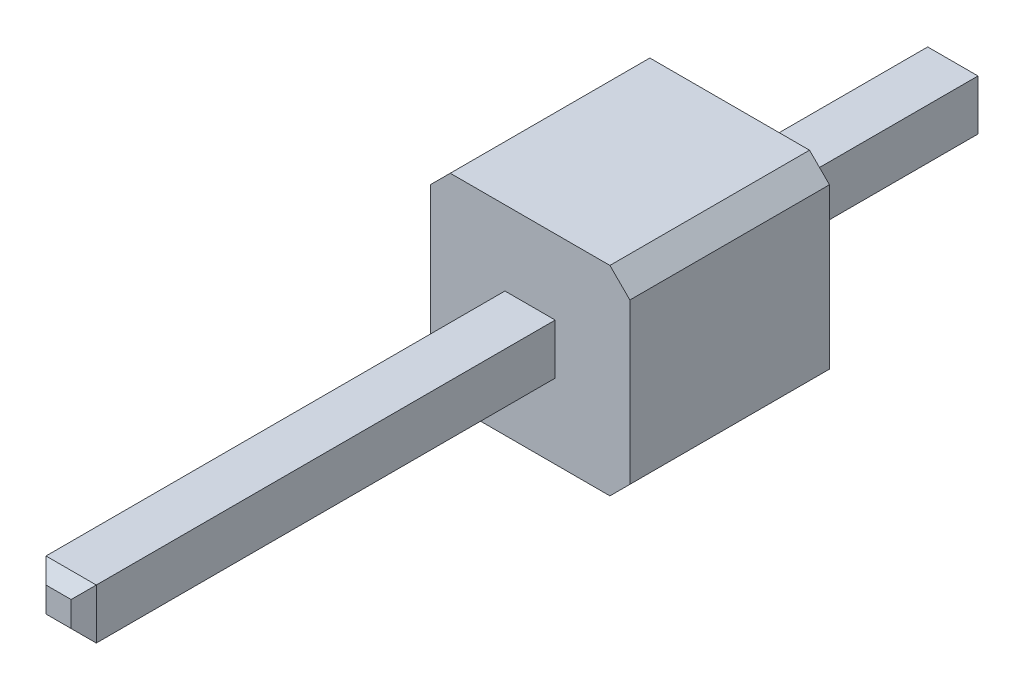
ISO-10303-21;
HEADER;
FILE_DESCRIPTION(('STEP AP214'),'2;1');
FILE_NAME('part.step','',(''),(''),'','','');
FILE_SCHEMA(('AUTOMOTIVE_DESIGN { 1 0 10303 214 1 1 1 1 }'));
ENDSEC;
DATA;
#1=APPLICATION_CONTEXT('core data for automotive mechanical design processes');
#2=APPLICATION_PROTOCOL_DEFINITION('international standard','automotive_design',2000,#1);
#3=PRODUCT_CONTEXT('',#1,'mechanical');
#4=PRODUCT('Part','Part','',(#3));
#5=PRODUCT_RELATED_PRODUCT_CATEGORY('part','',(#4));
#6=PRODUCT_DEFINITION_FORMATION('','',#4);
#7=PRODUCT_DEFINITION_CONTEXT('part definition',#1,'design');
#8=PRODUCT_DEFINITION('design','',#6,#7);
#9=PRODUCT_DEFINITION_SHAPE('','',#8);
#10=(LENGTH_UNIT() NAMED_UNIT(*) SI_UNIT(.MILLI.,.METRE.));
#11=(NAMED_UNIT(*) PLANE_ANGLE_UNIT() SI_UNIT($,.RADIAN.));
#12=(NAMED_UNIT(*) SI_UNIT($,.STERADIAN.) SOLID_ANGLE_UNIT());
#13=UNCERTAINTY_MEASURE_WITH_UNIT(LENGTH_MEASURE(1.E-05),#10,'distance_accuracy_value','');
#14=(GEOMETRIC_REPRESENTATION_CONTEXT(3) GLOBAL_UNCERTAINTY_ASSIGNED_CONTEXT((#13)) GLOBAL_UNIT_ASSIGNED_CONTEXT((#10,
#11,#12)) REPRESENTATION_CONTEXT('',''));
#15=CARTESIAN_POINT('',(0.,0.,0.));
#16=DIRECTION('',(0.,0.,1.));
#17=DIRECTION('',(1.,0.,0.));
#18=AXIS2_PLACEMENT_3D('',#15,#16,#17);
#19=CARTESIAN_POINT('',(-0.32,-0.32,8.54));
#20=DIRECTION('',(0.,0.,1.));
#21=DIRECTION('',(1.,0.,0.));
#22=AXIS2_PLACEMENT_3D('',#19,#20,#21);
#23=PLANE('',#22);
#24=DIRECTION('',(0.,1.,0.));
#25=VECTOR('',#24,1.);
#26=CARTESIAN_POINT('',(0.16,-0.32,8.54));
#27=LINE('',#26,#25);
#28=CARTESIAN_POINT('',(0.16,-0.16,8.54));
#29=VERTEX_POINT('',#28);
#30=CARTESIAN_POINT('',(0.16,0.16,8.54));
#31=VERTEX_POINT('',#30);
#32=EDGE_CURVE('E277',#29,#31,#27,.T.);
#33=ORIENTED_EDGE('',*,*,#32,.T.);
#34=DIRECTION('',(1.,0.,0.));
#35=VECTOR('',#34,1.);
#36=CARTESIAN_POINT('',(-0.32,0.16,8.54));
#37=LINE('',#36,#35);
#38=CARTESIAN_POINT('',(-0.16,0.16,8.54));
#39=VERTEX_POINT('',#38);
#40=EDGE_CURVE('E274',#39,#31,#37,.T.);
#41=ORIENTED_EDGE('',*,*,#40,.F.);
#42=DIRECTION('',(0.,1.,0.));
#43=VECTOR('',#42,1.);
#44=CARTESIAN_POINT('',(-0.16,-0.32,8.54));
#45=LINE('',#44,#43);
#46=CARTESIAN_POINT('',(-0.16,-0.16,8.54));
#47=VERTEX_POINT('',#46);
#48=EDGE_CURVE('E11',#47,#39,#45,.T.);
#49=ORIENTED_EDGE('',*,*,#48,.F.);
#50=DIRECTION('',(1.,0.,0.));
#51=VECTOR('',#50,1.);
#52=CARTESIAN_POINT('',(-0.32,-0.16,8.54));
#53=LINE('',#52,#51);
#54=EDGE_CURVE('E315',#47,#29,#53,.T.);
#55=ORIENTED_EDGE('',*,*,#54,.T.);
#56=EDGE_LOOP('',(#33,#41,#49,#55));
#57=FACE_BOUND('',#56,.T.);
#58=ADVANCED_FACE('F16',(#57),#23,.T.);
#59=CARTESIAN_POINT('',(-0.32,-0.32,-3.));
#60=DIRECTION('',(0.,0.,1.));
#61=DIRECTION('',(1.,0.,0.));
#62=AXIS2_PLACEMENT_3D('',#59,#60,#61);
#63=PLANE('',#62);
#64=DIRECTION('',(0.,1.,0.));
#65=VECTOR('',#64,1.);
#66=CARTESIAN_POINT('',(0.16,-0.32,-3.));
#67=LINE('',#66,#65);
#68=CARTESIAN_POINT('',(0.16,-0.16,-3.));
#69=VERTEX_POINT('',#68);
#70=CARTESIAN_POINT('',(0.16,0.16,-3.));
#71=VERTEX_POINT('',#70);
#72=EDGE_CURVE('E367',#69,#71,#67,.T.);
#73=ORIENTED_EDGE('',*,*,#72,.F.);
#74=DIRECTION('',(1.,0.,0.));
#75=VECTOR('',#74,1.);
#76=CARTESIAN_POINT('',(-0.32,-0.16,-3.));
#77=LINE('',#76,#75);
#78=CARTESIAN_POINT('',(-0.16,-0.16,-3.));
#79=VERTEX_POINT('',#78);
#80=EDGE_CURVE('E288',#79,#69,#77,.T.);
#81=ORIENTED_EDGE('',*,*,#80,.F.);
#82=DIRECTION('',(0.,1.,0.));
#83=VECTOR('',#82,1.);
#84=CARTESIAN_POINT('',(-0.16,-0.32,-3.));
#85=LINE('',#84,#83);
#86=CARTESIAN_POINT('',(-0.16,0.16,-3.));
#87=VERTEX_POINT('',#86);
#88=EDGE_CURVE('E250',#79,#87,#85,.T.);
#89=ORIENTED_EDGE('',*,*,#88,.T.);
#90=DIRECTION('',(1.,0.,0.));
#91=VECTOR('',#90,1.);
#92=CARTESIAN_POINT('',(-0.32,0.16,-3.));
#93=LINE('',#92,#91);
#94=EDGE_CURVE('E254',#87,#71,#93,.T.);
#95=ORIENTED_EDGE('',*,*,#94,.T.);
#96=EDGE_LOOP('',(#73,#81,#89,#95));
#97=FACE_BOUND('',#96,.T.);
#98=ADVANCED_FACE('F427',(#97),#63,.F.);
#99=CARTESIAN_POINT('',(-0.24,-0.32,8.46));
#100=DIRECTION('',(0.707106781186548,0.,-0.707106781186548));
#101=DIRECTION('',(0.,-1.,0.));
#102=AXIS2_PLACEMENT_3D('',#99,#100,#101);
#103=PLANE('',#102);
#104=ORIENTED_EDGE('',*,*,#48,.T.);
#105=DIRECTION('',(0.577350269189626,-0.577350269189626,0.577350269189626));
#106=VECTOR('',#105,1.);
#107=CARTESIAN_POINT('',(-0.16,0.16,8.54));
#108=LINE('',#107,#106);
#109=CARTESIAN_POINT('',(-0.32,0.32,8.38));
#110=VERTEX_POINT('',#109);
#111=EDGE_CURVE('E27',#110,#39,#108,.T.);
#112=ORIENTED_EDGE('',*,*,#111,.F.);
#113=DIRECTION('',(0.,1.,0.));
#114=VECTOR('',#113,1.);
#115=CARTESIAN_POINT('',(-0.32,-0.32,8.38));
#116=LINE('',#115,#114);
#117=CARTESIAN_POINT('',(-0.32,-0.32,8.38));
#118=VERTEX_POINT('',#117);
#119=EDGE_CURVE('E285',#118,#110,#116,.T.);
#120=ORIENTED_EDGE('',*,*,#119,.F.);
#121=DIRECTION('',(0.577350269189626,0.577350269189626,0.577350269189626));
#122=VECTOR('',#121,1.);
#123=CARTESIAN_POINT('',(-0.266666666667,-0.266666666667,8.433333333333));
#124=LINE('',#123,#122);
#125=EDGE_CURVE('E253',#118,#47,#124,.T.);
#126=ORIENTED_EDGE('',*,*,#125,.T.);
#127=EDGE_LOOP('',(#104,#112,#120,#126));
#128=FACE_BOUND('',#127,.T.);
#129=ADVANCED_FACE('F474',(#128),#103,.F.);
#130=CARTESIAN_POINT('',(-0.32,0.24,8.46));
#131=DIRECTION('',(0.,0.707106781186548,0.707106781186548));
#132=DIRECTION('',(1.,0.,0.));
#133=AXIS2_PLACEMENT_3D('',#130,#131,#132);
#134=PLANE('',#133);
#135=ORIENTED_EDGE('',*,*,#40,.T.);
#136=DIRECTION('',(-0.577350269189626,-0.577350269189626,0.577350269189626));
#137=VECTOR('',#136,1.);
#138=CARTESIAN_POINT('',(0.05333333333333,0.05333333333333,8.646666666667));
#139=LINE('',#138,#137);
#140=CARTESIAN_POINT('',(0.32,0.32,8.38));
#141=VERTEX_POINT('',#140);
#142=EDGE_CURVE('E313',#141,#31,#139,.T.);
#143=ORIENTED_EDGE('',*,*,#142,.F.);
#144=DIRECTION('',(1.,0.,0.));
#145=VECTOR('',#144,1.);
#146=CARTESIAN_POINT('',(-0.32,0.32,8.38));
#147=LINE('',#146,#145);
#148=EDGE_CURVE('E289',#110,#141,#147,.T.);
#149=ORIENTED_EDGE('',*,*,#148,.F.);
#150=ORIENTED_EDGE('',*,*,#111,.T.);
#151=EDGE_LOOP('',(#135,#143,#149,#150));
#152=FACE_BOUND('',#151,.T.);
#153=ADVANCED_FACE('F477',(#152),#134,.T.);
#154=CARTESIAN_POINT('',(0.24,-0.32,8.46));
#155=DIRECTION('',(0.707106781186548,0.,0.707106781186548));
#156=DIRECTION('',(0.,-1.,0.));
#157=AXIS2_PLACEMENT_3D('',#154,#155,#156);
#158=PLANE('',#157);
#159=DIRECTION('',(-0.577350269189626,0.577350269189626,0.577350269189626));
#160=VECTOR('',#159,1.);
#161=CARTESIAN_POINT('',(0.16,-0.16,8.54));
#162=LINE('',#161,#160);
#163=CARTESIAN_POINT('',(0.32,-0.32,8.38));
#164=VERTEX_POINT('',#163);
#165=EDGE_CURVE('E323',#164,#29,#162,.T.);
#166=ORIENTED_EDGE('',*,*,#165,.F.);
#167=DIRECTION('',(0.,1.,0.));
#168=VECTOR('',#167,1.);
#169=CARTESIAN_POINT('',(0.32,-0.32,8.38));
#170=LINE('',#169,#168);
#171=EDGE_CURVE('E310',#164,#141,#170,.T.);
#172=ORIENTED_EDGE('',*,*,#171,.T.);
#173=ORIENTED_EDGE('',*,*,#142,.T.);
#174=ORIENTED_EDGE('',*,*,#32,.F.);
#175=EDGE_LOOP('',(#166,#172,#173,#174));
#176=FACE_BOUND('',#175,.T.);
#177=ADVANCED_FACE('F478',(#176),#158,.T.);
#178=CARTESIAN_POINT('',(-0.32,-0.24,8.46));
#179=DIRECTION('',(0.,0.707106781186548,-0.707106781186548));
#180=DIRECTION('',(-1.,0.,0.));
#181=AXIS2_PLACEMENT_3D('',#178,#179,#180);
#182=PLANE('',#181);
#183=ORIENTED_EDGE('',*,*,#125,.F.);
#184=DIRECTION('',(1.,0.,0.));
#185=VECTOR('',#184,1.);
#186=CARTESIAN_POINT('',(-0.32,-0.32,8.38));
#187=LINE('',#186,#185);
#188=EDGE_CURVE('E362',#118,#164,#187,.T.);
#189=ORIENTED_EDGE('',*,*,#188,.T.);
#190=ORIENTED_EDGE('',*,*,#165,.T.);
#191=ORIENTED_EDGE('',*,*,#54,.F.);
#192=EDGE_LOOP('',(#183,#189,#190,#191));
#193=FACE_BOUND('',#192,.T.);
#194=ADVANCED_FACE('F473',(#193),#182,.F.);
#195=CARTESIAN_POINT('',(-0.24,-0.32,-2.92));
#196=DIRECTION('',(-0.707106781186548,0.,-0.707106781186548));
#197=DIRECTION('',(-0.707106781186548,0.,0.707106781186548));
#198=AXIS2_PLACEMENT_3D('',#195,#196,#197);
#199=PLANE('',#198);
#200=DIRECTION('',(0.577350269189626,0.577350269189626,-0.577350269189626));
#201=VECTOR('',#200,1.);
#202=CARTESIAN_POINT('',(-0.266666666667,-0.266666666667,-2.893333333333));
#203=LINE('',#202,#201);
#204=CARTESIAN_POINT('',(-0.32,-0.32,-2.84));
#205=VERTEX_POINT('',#204);
#206=EDGE_CURVE('E363',#205,#79,#203,.T.);
#207=ORIENTED_EDGE('',*,*,#206,.F.);
#208=DIRECTION('',(0.,1.,0.));
#209=VECTOR('',#208,1.);
#210=CARTESIAN_POINT('',(-0.32,-0.32,-2.84));
#211=LINE('',#210,#209);
#212=CARTESIAN_POINT('',(-0.32,0.32,-2.84));
#213=VERTEX_POINT('',#212);
#214=EDGE_CURVE('E385',#205,#213,#211,.T.);
#215=ORIENTED_EDGE('',*,*,#214,.T.);
#216=DIRECTION('',(0.577350269189626,-0.577350269189626,-0.577350269189626));
#217=VECTOR('',#216,1.);
#218=CARTESIAN_POINT('',(-0.16,0.16,-3.));
#219=LINE('',#218,#217);
#220=EDGE_CURVE('E376',#213,#87,#219,.T.);
#221=ORIENTED_EDGE('',*,*,#220,.T.);
#222=ORIENTED_EDGE('',*,*,#88,.F.);
#223=EDGE_LOOP('',(#207,#215,#221,#222));
#224=FACE_BOUND('',#223,.T.);
#225=ADVANCED_FACE('F486',(#224),#199,.T.);
#226=CARTESIAN_POINT('',(-0.32,0.24,-2.92));
#227=DIRECTION('',(0.,-0.707106781186548,0.707106781186548));
#228=DIRECTION('',(-1.,0.,0.));
#229=AXIS2_PLACEMENT_3D('',#226,#227,#228);
#230=PLANE('',#229);
#231=ORIENTED_EDGE('',*,*,#220,.F.);
#232=DIRECTION('',(1.,0.,0.));
#233=VECTOR('',#232,1.);
#234=CARTESIAN_POINT('',(-0.32,0.32,-2.84));
#235=LINE('',#234,#233);
#236=CARTESIAN_POINT('',(0.32,0.32,-2.84));
#237=VERTEX_POINT('',#236);
#238=EDGE_CURVE('E343',#213,#237,#235,.T.);
#239=ORIENTED_EDGE('',*,*,#238,.T.);
#240=DIRECTION('',(-0.577350269189626,-0.577350269189626,-0.577350269189626));
#241=VECTOR('',#240,1.);
#242=CARTESIAN_POINT('',(0.05333333333333,0.05333333333333,-3.106666666667));
#243=LINE('',#242,#241);
#244=EDGE_CURVE('E380',#237,#71,#243,.T.);
#245=ORIENTED_EDGE('',*,*,#244,.T.);
#246=ORIENTED_EDGE('',*,*,#94,.F.);
#247=EDGE_LOOP('',(#231,#239,#245,#246));
#248=FACE_BOUND('',#247,.T.);
#249=ADVANCED_FACE('F419',(#248),#230,.F.);
#250=CARTESIAN_POINT('',(0.24,-0.32,-2.92));
#251=DIRECTION('',(-0.707106781186548,0.,0.707106781186548));
#252=DIRECTION('',(0.,1.,0.));
#253=AXIS2_PLACEMENT_3D('',#250,#251,#252);
#254=PLANE('',#253);
#255=ORIENTED_EDGE('',*,*,#72,.T.);
#256=ORIENTED_EDGE('',*,*,#244,.F.);
#257=DIRECTION('',(0.,1.,0.));
#258=VECTOR('',#257,1.);
#259=CARTESIAN_POINT('',(0.32,-0.32,-2.84));
#260=LINE('',#259,#258);
#261=CARTESIAN_POINT('',(0.32,-0.32,-2.84));
#262=VERTEX_POINT('',#261);
#263=EDGE_CURVE('E344',#262,#237,#260,.T.);
#264=ORIENTED_EDGE('',*,*,#263,.F.);
#265=DIRECTION('',(-0.577350269189626,0.577350269189626,-0.577350269189626));
#266=VECTOR('',#265,1.);
#267=CARTESIAN_POINT('',(0.16,-0.16,-3.));
#268=LINE('',#267,#266);
#269=EDGE_CURVE('E298',#262,#69,#268,.T.);
#270=ORIENTED_EDGE('',*,*,#269,.T.);
#271=EDGE_LOOP('',(#255,#256,#264,#270));
#272=FACE_BOUND('',#271,.T.);
#273=ADVANCED_FACE('F424',(#272),#254,.F.);
#274=CARTESIAN_POINT('',(-0.32,-0.24,-2.92));
#275=DIRECTION('',(0.,-0.707106781186548,-0.707106781186548));
#276=DIRECTION('',(0.,-0.707106781186548,0.707106781186548));
#277=AXIS2_PLACEMENT_3D('',#274,#275,#276);
#278=PLANE('',#277);
#279=ORIENTED_EDGE('',*,*,#80,.T.);
#280=ORIENTED_EDGE('',*,*,#269,.F.);
#281=DIRECTION('',(1.,0.,0.));
#282=VECTOR('',#281,1.);
#283=CARTESIAN_POINT('',(-0.32,-0.32,-2.84));
#284=LINE('',#283,#282);
#285=EDGE_CURVE('E284',#205,#262,#284,.T.);
#286=ORIENTED_EDGE('',*,*,#285,.F.);
#287=ORIENTED_EDGE('',*,*,#206,.T.);
#288=EDGE_LOOP('',(#279,#280,#286,#287));
#289=FACE_BOUND('',#288,.T.);
#290=ADVANCED_FACE('F516',(#289),#278,.T.);
#291=CARTESIAN_POINT('',(-0.32,-0.32,-3.));
#292=DIRECTION('',(1.,0.,0.));
#293=DIRECTION('',(0.,1.,0.));
#294=AXIS2_PLACEMENT_3D('',#291,#292,#293);
#295=PLANE('',#294);
#296=ORIENTED_EDGE('',*,*,#119,.T.);
#297=DIRECTION('',(0.,0.,1.));
#298=VECTOR('',#297,1.);
#299=CARTESIAN_POINT('',(-0.32,0.32,-3.));
#300=LINE('',#299,#298);
#301=CARTESIAN_POINT('',(-0.32,0.32,2.54));
#302=VERTEX_POINT('',#301);
#303=EDGE_CURVE('E302',#302,#110,#300,.T.);
#304=ORIENTED_EDGE('',*,*,#303,.F.);
#305=DIRECTION('',(0.,1.,0.));
#306=VECTOR('',#305,1.);
#307=CARTESIAN_POINT('',(-0.32,-0.16,2.54));
#308=LINE('',#307,#306);
#309=CARTESIAN_POINT('',(-0.32,-0.32,2.54));
#310=VERTEX_POINT('',#309);
#311=EDGE_CURVE('E244',#310,#302,#308,.T.);
#312=ORIENTED_EDGE('',*,*,#311,.F.);
#313=DIRECTION('',(0.,0.,1.));
#314=VECTOR('',#313,1.);
#315=CARTESIAN_POINT('',(-0.32,-0.32,-3.));
#316=LINE('',#315,#314);
#317=EDGE_CURVE('E358',#310,#118,#316,.T.);
#318=ORIENTED_EDGE('',*,*,#317,.T.);
#319=EDGE_LOOP('',(#296,#304,#312,#318));
#320=FACE_BOUND('',#319,.T.);
#321=ADVANCED_FACE('F469',(#320),#295,.F.);
#322=CARTESIAN_POINT('',(-0.32,0.32,-3.));
#323=DIRECTION('',(0.,1.,0.));
#324=DIRECTION('',(1.,0.,0.));
#325=AXIS2_PLACEMENT_3D('',#322,#323,#324);
#326=PLANE('',#325);
#327=DIRECTION('',(0.,0.,1.));
#328=VECTOR('',#327,1.);
#329=CARTESIAN_POINT('',(0.32,0.32,-3.));
#330=LINE('',#329,#328);
#331=CARTESIAN_POINT('',(0.32,0.32,2.54));
#332=VERTEX_POINT('',#331);
#333=EDGE_CURVE('E413',#332,#141,#330,.T.);
#334=ORIENTED_EDGE('',*,*,#333,.F.);
#335=DIRECTION('',(-1.,0.,0.));
#336=VECTOR('',#335,1.);
#337=CARTESIAN_POINT('',(-0.16,0.32,2.54));
#338=LINE('',#337,#336);
#339=EDGE_CURVE('E248',#332,#302,#338,.T.);
#340=ORIENTED_EDGE('',*,*,#339,.T.);
#341=ORIENTED_EDGE('',*,*,#303,.T.);
#342=ORIENTED_EDGE('',*,*,#148,.T.);
#343=EDGE_LOOP('',(#334,#340,#341,#342));
#344=FACE_BOUND('',#343,.T.);
#345=ADVANCED_FACE('F465',(#344),#326,.T.);
#346=CARTESIAN_POINT('',(0.32,-0.32,-3.));
#347=DIRECTION('',(1.,0.,0.));
#348=DIRECTION('',(0.,1.,0.));
#349=AXIS2_PLACEMENT_3D('',#346,#347,#348);
#350=PLANE('',#349);
#351=DIRECTION('',(0.,0.,1.));
#352=VECTOR('',#351,1.);
#353=CARTESIAN_POINT('',(0.32,-0.32,-3.));
#354=LINE('',#353,#352);
#355=CARTESIAN_POINT('',(0.32,-0.32,2.54));
#356=VERTEX_POINT('',#355);
#357=EDGE_CURVE('E361',#356,#164,#354,.T.);
#358=ORIENTED_EDGE('',*,*,#357,.F.);
#359=DIRECTION('',(0.,1.,0.));
#360=VECTOR('',#359,1.);
#361=CARTESIAN_POINT('',(0.32,-0.16,2.54));
#362=LINE('',#361,#360);
#363=EDGE_CURVE('E273',#356,#332,#362,.T.);
#364=ORIENTED_EDGE('',*,*,#363,.T.);
#365=ORIENTED_EDGE('',*,*,#333,.T.);
#366=ORIENTED_EDGE('',*,*,#171,.F.);
#367=EDGE_LOOP('',(#358,#364,#365,#366));
#368=FACE_BOUND('',#367,.T.);
#369=ADVANCED_FACE('F462',(#368),#350,.T.);
#370=CARTESIAN_POINT('',(-0.32,-0.32,-3.));
#371=DIRECTION('',(0.,1.,0.));
#372=DIRECTION('',(1.,0.,0.));
#373=AXIS2_PLACEMENT_3D('',#370,#371,#372);
#374=PLANE('',#373);
#375=ORIENTED_EDGE('',*,*,#188,.F.);
#376=ORIENTED_EDGE('',*,*,#317,.F.);
#377=DIRECTION('',(-1.,0.,0.));
#378=VECTOR('',#377,1.);
#379=CARTESIAN_POINT('',(-0.16,-0.32,2.54));
#380=LINE('',#379,#378);
#381=EDGE_CURVE('E249',#356,#310,#380,.T.);
#382=ORIENTED_EDGE('',*,*,#381,.F.);
#383=ORIENTED_EDGE('',*,*,#357,.T.);
#384=EDGE_LOOP('',(#375,#376,#382,#383));
#385=FACE_BOUND('',#384,.T.);
#386=ADVANCED_FACE('F18',(#385),#374,.F.);
#387=CARTESIAN_POINT('',(-0.32,-0.32,-3.));
#388=DIRECTION('',(1.,0.,0.));
#389=DIRECTION('',(0.,1.,0.));
#390=AXIS2_PLACEMENT_3D('',#387,#388,#389);
#391=PLANE('',#390);
#392=DIRECTION('',(0.,1.,0.));
#393=VECTOR('',#392,1.);
#394=CARTESIAN_POINT('',(-0.32,-0.16,0.));
#395=LINE('',#394,#393);
#396=CARTESIAN_POINT('',(-0.32,-0.32,0.));
#397=VERTEX_POINT('',#396);
#398=CARTESIAN_POINT('',(-0.32,0.32,0.));
#399=VERTEX_POINT('',#398);
#400=EDGE_CURVE('E243',#397,#399,#395,.T.);
#401=ORIENTED_EDGE('',*,*,#400,.T.);
#402=DIRECTION('',(0.,0.,1.));
#403=VECTOR('',#402,1.);
#404=CARTESIAN_POINT('',(-0.32,0.32,-3.));
#405=LINE('',#404,#403);
#406=EDGE_CURVE('E388',#213,#399,#405,.T.);
#407=ORIENTED_EDGE('',*,*,#406,.F.);
#408=ORIENTED_EDGE('',*,*,#214,.F.);
#409=DIRECTION('',(0.,0.,1.));
#410=VECTOR('',#409,1.);
#411=CARTESIAN_POINT('',(-0.32,-0.32,-3.));
#412=LINE('',#411,#410);
#413=EDGE_CURVE('E267',#205,#397,#412,.T.);
#414=ORIENTED_EDGE('',*,*,#413,.T.);
#415=EDGE_LOOP('',(#401,#407,#408,#414));
#416=FACE_BOUND('',#415,.T.);
#417=ADVANCED_FACE('F501',(#416),#391,.F.);
#418=CARTESIAN_POINT('',(-0.32,0.32,-3.));
#419=DIRECTION('',(0.,1.,0.));
#420=DIRECTION('',(1.,0.,0.));
#421=AXIS2_PLACEMENT_3D('',#418,#419,#420);
#422=PLANE('',#421);
#423=DIRECTION('',(0.,0.,1.));
#424=VECTOR('',#423,1.);
#425=CARTESIAN_POINT('',(0.32,0.32,-3.));
#426=LINE('',#425,#424);
#427=CARTESIAN_POINT('',(0.32,0.32,0.));
#428=VERTEX_POINT('',#427);
#429=EDGE_CURVE('E340',#237,#428,#426,.T.);
#430=ORIENTED_EDGE('',*,*,#429,.F.);
#431=ORIENTED_EDGE('',*,*,#238,.F.);
#432=ORIENTED_EDGE('',*,*,#406,.T.);
#433=DIRECTION('',(-1.,0.,0.));
#434=VECTOR('',#433,1.);
#435=CARTESIAN_POINT('',(-0.16,0.32,0.));
#436=LINE('',#435,#434);
#437=EDGE_CURVE('E232',#428,#399,#436,.T.);
#438=ORIENTED_EDGE('',*,*,#437,.F.);
#439=EDGE_LOOP('',(#430,#431,#432,#438));
#440=FACE_BOUND('',#439,.T.);
#441=ADVANCED_FACE('F499',(#440),#422,.T.);
#442=CARTESIAN_POINT('',(0.32,-0.32,-3.));
#443=DIRECTION('',(1.,0.,0.));
#444=DIRECTION('',(0.,1.,0.));
#445=AXIS2_PLACEMENT_3D('',#442,#443,#444);
#446=PLANE('',#445);
#447=DIRECTION('',(0.,0.,1.));
#448=VECTOR('',#447,1.);
#449=CARTESIAN_POINT('',(0.32,-0.32,-3.));
#450=LINE('',#449,#448);
#451=CARTESIAN_POINT('',(0.32,-0.32,0.));
#452=VERTEX_POINT('',#451);
#453=EDGE_CURVE('E357',#262,#452,#450,.T.);
#454=ORIENTED_EDGE('',*,*,#453,.F.);
#455=ORIENTED_EDGE('',*,*,#263,.T.);
#456=ORIENTED_EDGE('',*,*,#429,.T.);
#457=DIRECTION('',(0.,1.,0.));
#458=VECTOR('',#457,1.);
#459=CARTESIAN_POINT('',(0.32,-0.16,0.));
#460=LINE('',#459,#458);
#461=EDGE_CURVE('E349',#452,#428,#460,.T.);
#462=ORIENTED_EDGE('',*,*,#461,.F.);
#463=EDGE_LOOP('',(#454,#455,#456,#462));
#464=FACE_BOUND('',#463,.T.);
#465=ADVANCED_FACE('F535',(#464),#446,.T.);
#466=CARTESIAN_POINT('',(-0.32,-0.32,-3.));
#467=DIRECTION('',(0.,1.,0.));
#468=DIRECTION('',(1.,0.,0.));
#469=AXIS2_PLACEMENT_3D('',#466,#467,#468);
#470=PLANE('',#469);
#471=DIRECTION('',(-1.,0.,0.));
#472=VECTOR('',#471,1.);
#473=CARTESIAN_POINT('',(-0.16,-0.32,0.));
#474=LINE('',#473,#472);
#475=EDGE_CURVE('E239',#452,#397,#474,.T.);
#476=ORIENTED_EDGE('',*,*,#475,.T.);
#477=ORIENTED_EDGE('',*,*,#413,.F.);
#478=ORIENTED_EDGE('',*,*,#285,.T.);
#479=ORIENTED_EDGE('',*,*,#453,.T.);
#480=EDGE_LOOP('',(#476,#477,#478,#479));
#481=FACE_BOUND('',#480,.T.);
#482=ADVANCED_FACE('F529',(#481),#470,.F.);
#483=CARTESIAN_POINT('',(1.016,-1.27,0.));
#484=DIRECTION('',(-0.707106781186548,0.707106781186548,0.));
#485=DIRECTION('',(0.,0.,1.));
#486=AXIS2_PLACEMENT_3D('',#483,#484,#485);
#487=PLANE('',#486);
#488=DIRECTION('',(0.707106781186548,0.707106781186548,0.));
#489=VECTOR('',#488,1.);
#490=CARTESIAN_POINT('',(1.016,-1.27,0.));
#491=LINE('',#490,#489);
#492=CARTESIAN_POINT('',(1.016,-1.27,0.));
#493=VERTEX_POINT('',#492);
#494=CARTESIAN_POINT('',(1.27,-1.016,0.));
#495=VERTEX_POINT('',#494);
#496=EDGE_CURVE('E368',#493,#495,#491,.T.);
#497=ORIENTED_EDGE('',*,*,#496,.T.);
#498=DIRECTION('',(0.,0.,1.));
#499=VECTOR('',#498,1.);
#500=CARTESIAN_POINT('',(1.27,-1.016,0.));
#501=LINE('',#500,#499);
#502=CARTESIAN_POINT('',(1.27,-1.016,2.54));
#503=VERTEX_POINT('',#502);
#504=EDGE_CURVE('E268',#495,#503,#501,.T.);
#505=ORIENTED_EDGE('',*,*,#504,.T.);
#506=DIRECTION('',(0.707106781186548,0.707106781186548,0.));
#507=VECTOR('',#506,1.);
#508=CARTESIAN_POINT('',(1.016,-1.27,2.54));
#509=LINE('',#508,#507);
#510=CARTESIAN_POINT('',(1.016,-1.27,2.54));
#511=VERTEX_POINT('',#510);
#512=EDGE_CURVE('E237',#511,#503,#509,.T.);
#513=ORIENTED_EDGE('',*,*,#512,.F.);
#514=DIRECTION('',(0.,0.,1.));
#515=VECTOR('',#514,1.);
#516=CARTESIAN_POINT('',(1.016,-1.27,0.));
#517=LINE('',#516,#515);
#518=EDGE_CURVE('E264',#493,#511,#517,.T.);
#519=ORIENTED_EDGE('',*,*,#518,.F.);
#520=EDGE_LOOP('',(#497,#505,#513,#519));
#521=FACE_BOUND('',#520,.T.);
#522=ADVANCED_FACE('F508',(#521),#487,.F.);
#523=CARTESIAN_POINT('',(-1.016,-1.27,0.));
#524=DIRECTION('',(0.,1.,0.));
#525=DIRECTION('',(1.,0.,0.));
#526=AXIS2_PLACEMENT_3D('',#523,#524,#525);
#527=PLANE('',#526);
#528=DIRECTION('',(1.,0.,0.));
#529=VECTOR('',#528,1.);
#530=CARTESIAN_POINT('',(-1.016,-1.27,0.));
#531=LINE('',#530,#529);
#532=CARTESIAN_POINT('',(-1.016,-1.27,0.));
#533=VERTEX_POINT('',#532);
#534=EDGE_CURVE('E350',#533,#493,#531,.T.);
#535=ORIENTED_EDGE('',*,*,#534,.T.);
#536=ORIENTED_EDGE('',*,*,#518,.T.);
#537=DIRECTION('',(1.,0.,0.));
#538=VECTOR('',#537,1.);
#539=CARTESIAN_POINT('',(-1.016,-1.27,2.54));
#540=LINE('',#539,#538);
#541=CARTESIAN_POINT('',(-1.016,-1.27,2.54));
#542=VERTEX_POINT('',#541);
#543=EDGE_CURVE('E234',#542,#511,#540,.T.);
#544=ORIENTED_EDGE('',*,*,#543,.F.);
#545=DIRECTION('',(0.,0.,1.));
#546=VECTOR('',#545,1.);
#547=CARTESIAN_POINT('',(-1.016,-1.27,0.));
#548=LINE('',#547,#546);
#549=EDGE_CURVE('E272',#533,#542,#548,.T.);
#550=ORIENTED_EDGE('',*,*,#549,.F.);
#551=EDGE_LOOP('',(#535,#536,#544,#550));
#552=FACE_BOUND('',#551,.T.);
#553=ADVANCED_FACE('F505',(#552),#527,.F.);
#554=CARTESIAN_POINT('',(1.27,-1.016,0.));
#555=DIRECTION('',(-1.,0.,0.));
#556=DIRECTION('',(0.,0.,1.));
#557=AXIS2_PLACEMENT_3D('',#554,#555,#556);
#558=PLANE('',#557);
#559=DIRECTION('',(0.,1.,0.));
#560=VECTOR('',#559,1.);
#561=CARTESIAN_POINT('',(1.27,-1.016,0.));
#562=LINE('',#561,#560);
#563=CARTESIAN_POINT('',(1.27,1.016,0.));
#564=VERTEX_POINT('',#563);
#565=EDGE_CURVE('E372',#495,#564,#562,.T.);
#566=ORIENTED_EDGE('',*,*,#565,.T.);
#567=DIRECTION('',(0.,0.,1.));
#568=VECTOR('',#567,1.);
#569=CARTESIAN_POINT('',(1.27,1.016,0.));
#570=LINE('',#569,#568);
#571=CARTESIAN_POINT('',(1.27,1.016,2.54));
#572=VERTEX_POINT('',#571);
#573=EDGE_CURVE('E269',#564,#572,#570,.T.);
#574=ORIENTED_EDGE('',*,*,#573,.T.);
#575=DIRECTION('',(0.,1.,0.));
#576=VECTOR('',#575,1.);
#577=CARTESIAN_POINT('',(1.27,-1.016,2.54));
#578=LINE('',#577,#576);
#579=EDGE_CURVE('E282',#503,#572,#578,.T.);
#580=ORIENTED_EDGE('',*,*,#579,.F.);
#581=ORIENTED_EDGE('',*,*,#504,.F.);
#582=EDGE_LOOP('',(#566,#574,#580,#581));
#583=FACE_BOUND('',#582,.T.);
#584=ADVANCED_FACE('F507',(#583),#558,.F.);
#585=CARTESIAN_POINT('',(-1.27,-1.016,0.));
#586=DIRECTION('',(0.707106781186548,0.707106781186548,0.));
#587=DIRECTION('',(0.,0.,-1.));
#588=AXIS2_PLACEMENT_3D('',#585,#586,#587);
#589=PLANE('',#588);
#590=DIRECTION('',(0.707106781186548,-0.707106781186548,0.));
#591=VECTOR('',#590,1.);
#592=CARTESIAN_POINT('',(-1.27,-1.016,0.));
#593=LINE('',#592,#591);
#594=CARTESIAN_POINT('',(-1.27,-1.016,0.));
#595=VERTEX_POINT('',#594);
#596=EDGE_CURVE('E345',#595,#533,#593,.T.);
#597=ORIENTED_EDGE('',*,*,#596,.T.);
#598=ORIENTED_EDGE('',*,*,#549,.T.);
#599=DIRECTION('',(0.707106781186548,-0.707106781186548,0.));
#600=VECTOR('',#599,1.);
#601=CARTESIAN_POINT('',(-1.27,-1.016,2.54));
#602=LINE('',#601,#600);
#603=CARTESIAN_POINT('',(-1.27,-1.016,2.54));
#604=VERTEX_POINT('',#603);
#605=EDGE_CURVE('E238',#604,#542,#602,.T.);
#606=ORIENTED_EDGE('',*,*,#605,.F.);
#607=DIRECTION('',(0.,0.,1.));
#608=VECTOR('',#607,1.);
#609=CARTESIAN_POINT('',(-1.27,-1.016,0.));
#610=LINE('',#609,#608);
#611=EDGE_CURVE('E258',#595,#604,#610,.T.);
#612=ORIENTED_EDGE('',*,*,#611,.F.);
#613=EDGE_LOOP('',(#597,#598,#606,#612));
#614=FACE_BOUND('',#613,.T.);
#615=ADVANCED_FACE('F540',(#614),#589,.F.);
#616=CARTESIAN_POINT('',(1.27,1.016,0.));
#617=DIRECTION('',(-0.707106781186548,-0.707106781186548,0.));
#618=DIRECTION('',(-0.707106781186548,0.707106781186548,0.));
#619=AXIS2_PLACEMENT_3D('',#616,#617,#618);
#620=PLANE('',#619);
#621=DIRECTION('',(-0.707106781186548,0.707106781186548,0.));
#622=VECTOR('',#621,1.);
#623=CARTESIAN_POINT('',(1.27,1.016,0.));
#624=LINE('',#623,#622);
#625=CARTESIAN_POINT('',(1.016,1.27,0.));
#626=VERTEX_POINT('',#625);
#627=EDGE_CURVE('E393',#564,#626,#624,.T.);
#628=ORIENTED_EDGE('',*,*,#627,.T.);
#629=DIRECTION('',(0.,0.,1.));
#630=VECTOR('',#629,1.);
#631=CARTESIAN_POINT('',(1.016,1.27,0.));
#632=LINE('',#631,#630);
#633=CARTESIAN_POINT('',(1.016,1.27,2.54));
#634=VERTEX_POINT('',#633);
#635=EDGE_CURVE('E20',#626,#634,#632,.T.);
#636=ORIENTED_EDGE('',*,*,#635,.T.);
#637=DIRECTION('',(-0.707106781186548,0.707106781186548,0.));
#638=VECTOR('',#637,1.);
#639=CARTESIAN_POINT('',(1.27,1.016,2.54));
#640=LINE('',#639,#638);
#641=EDGE_CURVE('E203',#572,#634,#640,.T.);
#642=ORIENTED_EDGE('',*,*,#641,.F.);
#643=ORIENTED_EDGE('',*,*,#573,.F.);
#644=EDGE_LOOP('',(#628,#636,#642,#643));
#645=FACE_BOUND('',#644,.T.);
#646=ADVANCED_FACE('F548',(#645),#620,.F.);
#647=CARTESIAN_POINT('',(0.,0.,2.54));
#648=DIRECTION('',(0.,0.,1.));
#649=DIRECTION('',(1.,0.,0.));
#650=AXIS2_PLACEMENT_3D('',#647,#648,#649);
#651=PLANE('',#650);
#652=ORIENTED_EDGE('',*,*,#381,.T.);
#653=ORIENTED_EDGE('',*,*,#311,.T.);
#654=ORIENTED_EDGE('',*,*,#339,.F.);
#655=ORIENTED_EDGE('',*,*,#363,.F.);
#656=EDGE_LOOP('',(#652,#653,#654,#655));
#657=FACE_BOUND('',#656,.T.);
#658=DIRECTION('',(-0.707106781186548,-0.707106781186548,0.));
#659=VECTOR('',#658,1.);
#660=CARTESIAN_POINT('',(-1.016,1.27,2.54));
#661=LINE('',#660,#659);
#662=CARTESIAN_POINT('',(-1.016,1.27,2.54));
#663=VERTEX_POINT('',#662);
#664=CARTESIAN_POINT('',(-1.27,1.016,2.54));
#665=VERTEX_POINT('',#664);
#666=EDGE_CURVE('E199',#663,#665,#661,.T.);
#667=ORIENTED_EDGE('',*,*,#666,.T.);
#668=DIRECTION('',(0.,-1.,0.));
#669=VECTOR('',#668,1.);
#670=CARTESIAN_POINT('',(-1.27,1.016,2.54));
#671=LINE('',#670,#669);
#672=EDGE_CURVE('E262',#665,#604,#671,.T.);
#673=ORIENTED_EDGE('',*,*,#672,.T.);
#674=ORIENTED_EDGE('',*,*,#605,.T.);
#675=ORIENTED_EDGE('',*,*,#543,.T.);
#676=ORIENTED_EDGE('',*,*,#512,.T.);
#677=ORIENTED_EDGE('',*,*,#579,.T.);
#678=ORIENTED_EDGE('',*,*,#641,.T.);
#679=DIRECTION('',(-1.,0.,0.));
#680=VECTOR('',#679,1.);
#681=CARTESIAN_POINT('',(1.016,1.27,2.54));
#682=LINE('',#681,#680);
#683=EDGE_CURVE('E194',#634,#663,#682,.T.);
#684=ORIENTED_EDGE('',*,*,#683,.T.);
#685=EDGE_LOOP('',(#667,#673,#674,#675,#676,#677,#678,#684));
#686=FACE_BOUND('',#685,.T.);
#687=ADVANCED_FACE('F196',(#657,#686),#651,.T.);
#688=CARTESIAN_POINT('',(0.,0.,0.));
#689=DIRECTION('',(0.,0.,1.));
#690=DIRECTION('',(1.,0.,0.));
#691=AXIS2_PLACEMENT_3D('',#688,#689,#690);
#692=PLANE('',#691);
#693=ORIENTED_EDGE('',*,*,#461,.T.);
#694=ORIENTED_EDGE('',*,*,#437,.T.);
#695=ORIENTED_EDGE('',*,*,#400,.F.);
#696=ORIENTED_EDGE('',*,*,#475,.F.);
#697=EDGE_LOOP('',(#693,#694,#695,#696));
#698=FACE_BOUND('',#697,.T.);
#699=DIRECTION('',(-1.,0.,0.));
#700=VECTOR('',#699,1.);
#701=CARTESIAN_POINT('',(1.016,1.27,0.));
#702=LINE('',#701,#700);
#703=CARTESIAN_POINT('',(-1.016,1.27,0.));
#704=VERTEX_POINT('',#703);
#705=EDGE_CURVE('E208',#626,#704,#702,.T.);
#706=ORIENTED_EDGE('',*,*,#705,.F.);
#707=ORIENTED_EDGE('',*,*,#627,.F.);
#708=ORIENTED_EDGE('',*,*,#565,.F.);
#709=ORIENTED_EDGE('',*,*,#496,.F.);
#710=ORIENTED_EDGE('',*,*,#534,.F.);
#711=ORIENTED_EDGE('',*,*,#596,.F.);
#712=DIRECTION('',(0.,-1.,0.));
#713=VECTOR('',#712,1.);
#714=CARTESIAN_POINT('',(-1.27,1.016,0.));
#715=LINE('',#714,#713);
#716=CARTESIAN_POINT('',(-1.27,1.016,0.));
#717=VERTEX_POINT('',#716);
#718=EDGE_CURVE('E263',#717,#595,#715,.T.);
#719=ORIENTED_EDGE('',*,*,#718,.F.);
#720=DIRECTION('',(-0.707106781186548,-0.707106781186548,0.));
#721=VECTOR('',#720,1.);
#722=CARTESIAN_POINT('',(-1.016,1.27,0.));
#723=LINE('',#722,#721);
#724=EDGE_CURVE('E228',#704,#717,#723,.T.);
#725=ORIENTED_EDGE('',*,*,#724,.F.);
#726=EDGE_LOOP('',(#706,#707,#708,#709,#710,#711,#719,#725));
#727=FACE_BOUND('',#726,.T.);
#728=ADVANCED_FACE('F523',(#698,#727),#692,.F.);
#729=CARTESIAN_POINT('',(-1.27,1.016,0.));
#730=DIRECTION('',(1.,0.,0.));
#731=DIRECTION('',(0.,1.,0.));
#732=AXIS2_PLACEMENT_3D('',#729,#730,#731);
#733=PLANE('',#732);
#734=ORIENTED_EDGE('',*,*,#718,.T.);
#735=ORIENTED_EDGE('',*,*,#611,.T.);
#736=ORIENTED_EDGE('',*,*,#672,.F.);
#737=DIRECTION('',(0.,0.,1.));
#738=VECTOR('',#737,1.);
#739=CARTESIAN_POINT('',(-1.27,1.016,0.));
#740=LINE('',#739,#738);
#741=EDGE_CURVE('E221',#717,#665,#740,.T.);
#742=ORIENTED_EDGE('',*,*,#741,.F.);
#743=EDGE_LOOP('',(#734,#735,#736,#742));
#744=FACE_BOUND('',#743,.T.);
#745=ADVANCED_FACE('F526',(#744),#733,.F.);
#746=CARTESIAN_POINT('',(1.016,1.27,0.));
#747=DIRECTION('',(0.,-1.,0.));
#748=DIRECTION('',(0.,0.,-1.));
#749=AXIS2_PLACEMENT_3D('',#746,#747,#748);
#750=PLANE('',#749);
#751=ORIENTED_EDGE('',*,*,#705,.T.);
#752=DIRECTION('',(0.,0.,1.));
#753=VECTOR('',#752,1.);
#754=CARTESIAN_POINT('',(-1.016,1.27,0.));
#755=LINE('',#754,#753);
#756=EDGE_CURVE('E211',#704,#663,#755,.T.);
#757=ORIENTED_EDGE('',*,*,#756,.T.);
#758=ORIENTED_EDGE('',*,*,#683,.F.);
#759=ORIENTED_EDGE('',*,*,#635,.F.);
#760=EDGE_LOOP('',(#751,#757,#758,#759));
#761=FACE_BOUND('',#760,.T.);
#762=ADVANCED_FACE('F212',(#761),#750,.F.);
#763=CARTESIAN_POINT('',(-1.016,1.27,0.));
#764=DIRECTION('',(0.707106781186548,-0.707106781186548,0.));
#765=DIRECTION('',(0.,0.,-1.));
#766=AXIS2_PLACEMENT_3D('',#763,#764,#765);
#767=PLANE('',#766);
#768=ORIENTED_EDGE('',*,*,#724,.T.);
#769=ORIENTED_EDGE('',*,*,#741,.T.);
#770=ORIENTED_EDGE('',*,*,#666,.F.);
#771=ORIENTED_EDGE('',*,*,#756,.F.);
#772=EDGE_LOOP('',(#768,#769,#770,#771));
#773=FACE_BOUND('',#772,.T.);
#774=ADVANCED_FACE('F219',(#773),#767,.F.);
#775=CLOSED_SHELL('',(#58,#98,#129,#153,#177,#194,#225,#249,#273,#290,#321,#345,#369,#386,#417,
#441,#465,#482,#522,#553,#584,#615,#646,#687,#728,#745,#762,#774));
#776=MANIFOLD_SOLID_BREP('B1',#775);
#777=ADVANCED_BREP_SHAPE_REPRESENTATION('',(#18,#776),#14);
#778=SHAPE_DEFINITION_REPRESENTATION(#9,#777);
ENDSEC;
END-ISO-10303-21;
